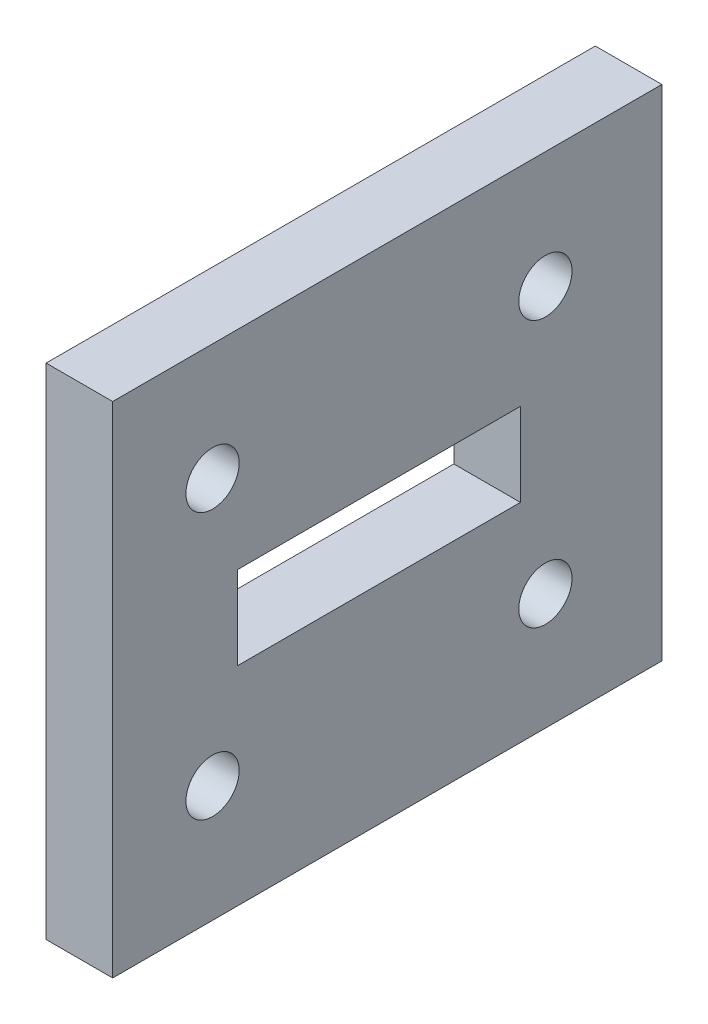
ISO-10303-21;
HEADER;
FILE_DESCRIPTION(('STEP AP214'),'2;1');
FILE_NAME('part.step','',(''),(''),'','','');
FILE_SCHEMA(('AUTOMOTIVE_DESIGN { 1 0 10303 214 1 1 1 1 }'));
ENDSEC;
DATA;
#1=APPLICATION_CONTEXT('core data for automotive mechanical design processes');
#2=APPLICATION_PROTOCOL_DEFINITION('international standard','automotive_design',2000,#1);
#3=PRODUCT_CONTEXT('',#1,'mechanical');
#4=PRODUCT('Part','Part','',(#3));
#5=PRODUCT_RELATED_PRODUCT_CATEGORY('part','',(#4));
#6=PRODUCT_DEFINITION_FORMATION('','',#4);
#7=PRODUCT_DEFINITION_CONTEXT('part definition',#1,'design');
#8=PRODUCT_DEFINITION('design','',#6,#7);
#9=PRODUCT_DEFINITION_SHAPE('','',#8);
#10=(LENGTH_UNIT() NAMED_UNIT(*) SI_UNIT(.MILLI.,.METRE.));
#11=(NAMED_UNIT(*) PLANE_ANGLE_UNIT() SI_UNIT($,.RADIAN.));
#12=(NAMED_UNIT(*) SI_UNIT($,.STERADIAN.) SOLID_ANGLE_UNIT());
#13=UNCERTAINTY_MEASURE_WITH_UNIT(LENGTH_MEASURE(1.E-05),#10,'distance_accuracy_value','');
#14=(GEOMETRIC_REPRESENTATION_CONTEXT(3) GLOBAL_UNCERTAINTY_ASSIGNED_CONTEXT((#13)) GLOBAL_UNIT_ASSIGNED_CONTEXT((#10,
#11,#12)) REPRESENTATION_CONTEXT('',''));
#15=CARTESIAN_POINT('',(0.,0.,0.));
#16=DIRECTION('',(0.,0.,1.));
#17=DIRECTION('',(1.,0.,0.));
#18=AXIS2_PLACEMENT_3D('',#15,#16,#17);
#19=CARTESIAN_POINT('',(19.4739237782046,0.,0.));
#20=DIRECTION('',(1.,0.,0.));
#21=DIRECTION('',(0.,1.,0.));
#22=AXIS2_PLACEMENT_3D('',#19,#20,#21);
#23=PLANE('',#22);
#24=DIRECTION('',(0.,0.,-1.));
#25=VECTOR('',#24,1.);
#26=CARTESIAN_POINT('',(19.4739237782046,25.9936178572667,-11.2636966730218));
#27=LINE('',#26,#25);
#28=CARTESIAN_POINT('',(19.4739237782046,25.9936178572667,5.73630332697818));
#29=VERTEX_POINT('',#28);
#30=CARTESIAN_POINT('',(19.4739237782046,25.9936178572667,-11.2636966730218));
#31=VERTEX_POINT('',#30);
#32=EDGE_CURVE('E102',#29,#31,#27,.T.);
#33=ORIENTED_EDGE('',*,*,#32,.T.);
#34=DIRECTION('',(0.,-1.,0.));
#35=VECTOR('',#34,1.);
#36=CARTESIAN_POINT('',(19.4739237782046,25.9936178572667,-11.2636966730218));
#37=LINE('',#36,#35);
#38=CARTESIAN_POINT('',(19.4739237782046,20.9936178572667,-11.2636966730218));
#39=VERTEX_POINT('',#38);
#40=EDGE_CURVE('E111',#31,#39,#37,.T.);
#41=ORIENTED_EDGE('',*,*,#40,.T.);
#42=DIRECTION('',(0.,0.,1.));
#43=VECTOR('',#42,1.);
#44=CARTESIAN_POINT('',(19.4739237782046,20.9936178572667,-11.2636966730218));
#45=LINE('',#44,#43);
#46=CARTESIAN_POINT('',(19.4739237782046,20.9936178572667,5.73630332697818));
#47=VERTEX_POINT('',#46);
#48=EDGE_CURVE('E50',#39,#47,#45,.T.);
#49=ORIENTED_EDGE('',*,*,#48,.T.);
#50=DIRECTION('',(0.,1.,0.));
#51=VECTOR('',#50,1.);
#52=CARTESIAN_POINT('',(19.4739237782046,25.9936178572667,5.73630332697818));
#53=LINE('',#52,#51);
#54=EDGE_CURVE('E108',#47,#29,#53,.T.);
#55=ORIENTED_EDGE('',*,*,#54,.T.);
#56=EDGE_LOOP('',(#33,#41,#49,#55));
#57=FACE_BOUND('',#56,.T.);
#58=CARTESIAN_POINT('',(19.4739237782046,15.4936178572667,7.23630332697818));
#59=DIRECTION('',(1.,0.,0.));
#60=DIRECTION('',(0.,0.,-1.));
#61=AXIS2_PLACEMENT_3D('',#58,#59,#60);
#62=CIRCLE('',#61,1.6);
#63=CARTESIAN_POINT('',(19.4739237782046,15.4936178572667,5.63630332697818));
#64=VERTEX_POINT('',#63);
#65=EDGE_CURVE('E142',#64,#64,#62,.T.);
#66=ORIENTED_EDGE('',*,*,#65,.F.);
#67=EDGE_LOOP('',(#66));
#68=FACE_BOUND('',#67,.T.);
#69=CARTESIAN_POINT('',(19.4739237782046,31.4936178572667,7.23630332697817));
#70=DIRECTION('',(1.,0.,0.));
#71=DIRECTION('',(0.,0.,-1.));
#72=AXIS2_PLACEMENT_3D('',#69,#70,#71);
#73=CIRCLE('',#72,1.6);
#74=CARTESIAN_POINT('',(19.4739237782046,31.4936178572667,5.63630332697818));
#75=VERTEX_POINT('',#74);
#76=EDGE_CURVE('E154',#75,#75,#73,.T.);
#77=ORIENTED_EDGE('',*,*,#76,.F.);
#78=EDGE_LOOP('',(#77));
#79=FACE_BOUND('',#78,.T.);
#80=DIRECTION('',(0.,0.,1.));
#81=VECTOR('',#80,1.);
#82=CARTESIAN_POINT('',(19.4739237782046,38.4936178572667,-19.7636966730218));
#83=LINE('',#82,#81);
#84=CARTESIAN_POINT('',(19.4739237782046,38.4936178572667,-19.7636966730218));
#85=VERTEX_POINT('',#84);
#86=CARTESIAN_POINT('',(19.4739237782046,38.4936178572667,13.2363033269782));
#87=VERTEX_POINT('',#86);
#88=EDGE_CURVE('E160',#85,#87,#83,.T.);
#89=ORIENTED_EDGE('',*,*,#88,.T.);
#90=DIRECTION('',(0.,-1.,0.));
#91=VECTOR('',#90,1.);
#92=CARTESIAN_POINT('',(19.4739237782046,38.4936178572667,13.2363033269782));
#93=LINE('',#92,#91);
#94=CARTESIAN_POINT('',(19.4739237782046,8.49361785726671,13.2363033269782));
#95=VERTEX_POINT('',#94);
#96=EDGE_CURVE('E163',#87,#95,#93,.T.);
#97=ORIENTED_EDGE('',*,*,#96,.T.);
#98=DIRECTION('',(0.,0.,-1.));
#99=VECTOR('',#98,1.);
#100=CARTESIAN_POINT('',(19.4739237782046,8.49361785726671,13.2363033269782));
#101=LINE('',#100,#99);
#102=CARTESIAN_POINT('',(19.4739237782046,8.49361785726672,-19.7636966730218));
#103=VERTEX_POINT('',#102);
#104=EDGE_CURVE('E166',#95,#103,#101,.T.);
#105=ORIENTED_EDGE('',*,*,#104,.T.);
#106=DIRECTION('',(0.,1.,0.));
#107=VECTOR('',#106,1.);
#108=CARTESIAN_POINT('',(19.4739237782046,8.49361785726672,-19.7636966730218));
#109=LINE('',#108,#107);
#110=EDGE_CURVE('E168',#103,#85,#109,.T.);
#111=ORIENTED_EDGE('',*,*,#110,.T.);
#112=EDGE_LOOP('',(#89,#97,#105,#111));
#113=FACE_BOUND('',#112,.T.);
#114=CARTESIAN_POINT('',(19.4739237782046,31.4936178572667,-12.7636966730218));
#115=DIRECTION('',(1.,0.,0.));
#116=DIRECTION('',(0.,0.,-1.));
#117=AXIS2_PLACEMENT_3D('',#114,#115,#116);
#118=CIRCLE('',#117,1.6);
#119=CARTESIAN_POINT('',(19.4739237782046,31.4936178572667,-14.3636966730218));
#120=VERTEX_POINT('',#119);
#121=EDGE_CURVE('E148',#120,#120,#118,.T.);
#122=ORIENTED_EDGE('',*,*,#121,.F.);
#123=EDGE_LOOP('',(#122));
#124=FACE_BOUND('',#123,.T.);
#125=CARTESIAN_POINT('',(19.4739237782046,15.4936178572667,-12.7636966730218));
#126=DIRECTION('',(1.,0.,0.));
#127=DIRECTION('',(0.,0.,-1.));
#128=AXIS2_PLACEMENT_3D('',#125,#126,#127);
#129=CIRCLE('',#128,1.6);
#130=CARTESIAN_POINT('',(19.4739237782046,15.4936178572667,-14.3636966730218));
#131=VERTEX_POINT('',#130);
#132=EDGE_CURVE('E136',#131,#131,#129,.T.);
#133=ORIENTED_EDGE('',*,*,#132,.F.);
#134=EDGE_LOOP('',(#133));
#135=FACE_BOUND('',#134,.T.);
#136=ADVANCED_FACE('F35',(#57,#68,#79,#113,#124,#135),#23,.T.);
#137=CARTESIAN_POINT('',(15.4739237782046,0.,0.));
#138=DIRECTION('',(1.,0.,0.));
#139=DIRECTION('',(0.,1.,0.));
#140=AXIS2_PLACEMENT_3D('',#137,#138,#139);
#141=PLANE('',#140);
#142=DIRECTION('',(0.,-1.,0.));
#143=VECTOR('',#142,1.);
#144=CARTESIAN_POINT('',(15.4739237782046,25.9936178572667,-11.2636966730218));
#145=LINE('',#144,#143);
#146=CARTESIAN_POINT('',(15.4739237782046,25.9936178572667,-11.2636966730218));
#147=VERTEX_POINT('',#146);
#148=CARTESIAN_POINT('',(15.4739237782046,20.9936178572667,-11.2636966730218));
#149=VERTEX_POINT('',#148);
#150=EDGE_CURVE('E126',#147,#149,#145,.T.);
#151=ORIENTED_EDGE('',*,*,#150,.F.);
#152=DIRECTION('',(0.,0.,-1.));
#153=VECTOR('',#152,1.);
#154=CARTESIAN_POINT('',(15.4739237782046,25.9936178572667,-11.2636966730218));
#155=LINE('',#154,#153);
#156=CARTESIAN_POINT('',(15.4739237782046,25.9936178572667,5.73630332697818));
#157=VERTEX_POINT('',#156);
#158=EDGE_CURVE('E58',#157,#147,#155,.T.);
#159=ORIENTED_EDGE('',*,*,#158,.F.);
#160=DIRECTION('',(0.,1.,0.));
#161=VECTOR('',#160,1.);
#162=CARTESIAN_POINT('',(15.4739237782046,25.9936178572667,5.73630332697818));
#163=LINE('',#162,#161);
#164=CARTESIAN_POINT('',(15.4739237782046,20.9936178572667,5.73630332697818));
#165=VERTEX_POINT('',#164);
#166=EDGE_CURVE('E117',#165,#157,#163,.T.);
#167=ORIENTED_EDGE('',*,*,#166,.F.);
#168=DIRECTION('',(0.,0.,1.));
#169=VECTOR('',#168,1.);
#170=CARTESIAN_POINT('',(15.4739237782046,20.9936178572667,-11.2636966730218));
#171=LINE('',#170,#169);
#172=EDGE_CURVE('E120',#149,#165,#171,.T.);
#173=ORIENTED_EDGE('',*,*,#172,.F.);
#174=EDGE_LOOP('',(#151,#159,#167,#173));
#175=FACE_BOUND('',#174,.T.);
#176=DIRECTION('',(0.,0.,1.));
#177=VECTOR('',#176,1.);
#178=CARTESIAN_POINT('',(15.4739237782046,38.4936178572667,-19.7636966730218));
#179=LINE('',#178,#177);
#180=CARTESIAN_POINT('',(15.4739237782046,38.4936178572667,-19.7636966730218));
#181=VERTEX_POINT('',#180);
#182=CARTESIAN_POINT('',(15.4739237782046,38.4936178572667,13.2363033269782));
#183=VERTEX_POINT('',#182);
#184=EDGE_CURVE('E157',#181,#183,#179,.T.);
#185=ORIENTED_EDGE('',*,*,#184,.F.);
#186=DIRECTION('',(0.,1.,0.));
#187=VECTOR('',#186,1.);
#188=CARTESIAN_POINT('',(15.4739237782046,8.49361785726672,-19.7636966730218));
#189=LINE('',#188,#187);
#190=CARTESIAN_POINT('',(15.4739237782046,8.49361785726672,-19.7636966730218));
#191=VERTEX_POINT('',#190);
#192=EDGE_CURVE('E164',#191,#181,#189,.T.);
#193=ORIENTED_EDGE('',*,*,#192,.F.);
#194=DIRECTION('',(0.,0.,-1.));
#195=VECTOR('',#194,1.);
#196=CARTESIAN_POINT('',(15.4739237782046,8.49361785726671,13.2363033269782));
#197=LINE('',#196,#195);
#198=CARTESIAN_POINT('',(15.4739237782046,8.49361785726671,13.2363033269782));
#199=VERTEX_POINT('',#198);
#200=EDGE_CURVE('E175',#199,#191,#197,.T.);
#201=ORIENTED_EDGE('',*,*,#200,.F.);
#202=DIRECTION('',(0.,-1.,0.));
#203=VECTOR('',#202,1.);
#204=CARTESIAN_POINT('',(15.4739237782046,38.4936178572667,13.2363033269782));
#205=LINE('',#204,#203);
#206=EDGE_CURVE('E173',#183,#199,#205,.T.);
#207=ORIENTED_EDGE('',*,*,#206,.F.);
#208=EDGE_LOOP('',(#185,#193,#201,#207));
#209=FACE_BOUND('',#208,.T.);
#210=CARTESIAN_POINT('',(15.4739237782046,31.4936178572667,7.23630332697817));
#211=DIRECTION('',(1.,0.,0.));
#212=DIRECTION('',(0.,0.,-1.));
#213=AXIS2_PLACEMENT_3D('',#210,#211,#212);
#214=CIRCLE('',#213,1.6);
#215=CARTESIAN_POINT('',(15.4739237782046,31.4936178572667,5.63630332697818));
#216=VERTEX_POINT('',#215);
#217=EDGE_CURVE('E151',#216,#216,#214,.T.);
#218=ORIENTED_EDGE('',*,*,#217,.T.);
#219=EDGE_LOOP('',(#218));
#220=FACE_BOUND('',#219,.T.);
#221=CARTESIAN_POINT('',(15.4739237782046,31.4936178572667,-12.7636966730218));
#222=DIRECTION('',(1.,0.,0.));
#223=DIRECTION('',(0.,0.,-1.));
#224=AXIS2_PLACEMENT_3D('',#221,#222,#223);
#225=CIRCLE('',#224,1.6);
#226=CARTESIAN_POINT('',(15.4739237782046,31.4936178572667,-14.3636966730218));
#227=VERTEX_POINT('',#226);
#228=EDGE_CURVE('E145',#227,#227,#225,.T.);
#229=ORIENTED_EDGE('',*,*,#228,.T.);
#230=EDGE_LOOP('',(#229));
#231=FACE_BOUND('',#230,.T.);
#232=CARTESIAN_POINT('',(15.4739237782046,15.4936178572667,7.23630332697818));
#233=DIRECTION('',(1.,0.,0.));
#234=DIRECTION('',(0.,0.,-1.));
#235=AXIS2_PLACEMENT_3D('',#232,#233,#234);
#236=CIRCLE('',#235,1.6);
#237=CARTESIAN_POINT('',(15.4739237782046,15.4936178572667,5.63630332697818));
#238=VERTEX_POINT('',#237);
#239=EDGE_CURVE('E139',#238,#238,#236,.T.);
#240=ORIENTED_EDGE('',*,*,#239,.T.);
#241=EDGE_LOOP('',(#240));
#242=FACE_BOUND('',#241,.T.);
#243=CARTESIAN_POINT('',(15.4739237782046,15.4936178572667,-12.7636966730218));
#244=DIRECTION('',(1.,0.,0.));
#245=DIRECTION('',(0.,0.,-1.));
#246=AXIS2_PLACEMENT_3D('',#243,#244,#245);
#247=CIRCLE('',#246,1.6);
#248=CARTESIAN_POINT('',(15.4739237782046,15.4936178572667,-14.3636966730218));
#249=VERTEX_POINT('',#248);
#250=EDGE_CURVE('E132',#249,#249,#247,.T.);
#251=ORIENTED_EDGE('',*,*,#250,.T.);
#252=EDGE_LOOP('',(#251));
#253=FACE_BOUND('',#252,.T.);
#254=ADVANCED_FACE('F193',(#175,#209,#220,#231,#242,#253),#141,.F.);
#255=CARTESIAN_POINT('',(19.4739237782046,38.4936178572667,-19.7636966730218));
#256=DIRECTION('',(0.,-1.,0.));
#257=DIRECTION('',(1.,0.,0.));
#258=AXIS2_PLACEMENT_3D('',#255,#256,#257);
#259=PLANE('',#258);
#260=ORIENTED_EDGE('',*,*,#184,.T.);
#261=DIRECTION('',(-1.,0.,0.));
#262=VECTOR('',#261,1.);
#263=CARTESIAN_POINT('',(19.4739237782046,38.4936178572667,13.2363033269782));
#264=LINE('',#263,#262);
#265=EDGE_CURVE('E11',#87,#183,#264,.T.);
#266=ORIENTED_EDGE('',*,*,#265,.F.);
#267=ORIENTED_EDGE('',*,*,#88,.F.);
#268=DIRECTION('',(-1.,0.,0.));
#269=VECTOR('',#268,1.);
#270=CARTESIAN_POINT('',(19.4739237782046,38.4936178572667,-19.7636966730218));
#271=LINE('',#270,#269);
#272=EDGE_CURVE('E170',#85,#181,#271,.T.);
#273=ORIENTED_EDGE('',*,*,#272,.T.);
#274=EDGE_LOOP('',(#260,#266,#267,#273));
#275=FACE_BOUND('',#274,.T.);
#276=ADVANCED_FACE('F37',(#275),#259,.F.);
#277=CARTESIAN_POINT('',(19.4739237782046,38.4936178572667,13.2363033269782));
#278=DIRECTION('',(0.,0.,-1.));
#279=DIRECTION('',(-1.,0.,0.));
#280=AXIS2_PLACEMENT_3D('',#277,#278,#279);
#281=PLANE('',#280);
#282=ORIENTED_EDGE('',*,*,#206,.T.);
#283=DIRECTION('',(-1.,0.,0.));
#284=VECTOR('',#283,1.);
#285=CARTESIAN_POINT('',(19.4739237782046,8.49361785726671,13.2363033269782));
#286=LINE('',#285,#284);
#287=EDGE_CURVE('E43',#95,#199,#286,.T.);
#288=ORIENTED_EDGE('',*,*,#287,.F.);
#289=ORIENTED_EDGE('',*,*,#96,.F.);
#290=ORIENTED_EDGE('',*,*,#265,.T.);
#291=EDGE_LOOP('',(#282,#288,#289,#290));
#292=FACE_BOUND('',#291,.T.);
#293=ADVANCED_FACE('F204',(#292),#281,.F.);
#294=CARTESIAN_POINT('',(19.4739237782046,8.49361785726671,13.2363033269782));
#295=DIRECTION('',(0.,1.,0.));
#296=DIRECTION('',(-1.,0.,0.));
#297=AXIS2_PLACEMENT_3D('',#294,#295,#296);
#298=PLANE('',#297);
#299=ORIENTED_EDGE('',*,*,#200,.T.);
#300=DIRECTION('',(-1.,0.,0.));
#301=VECTOR('',#300,1.);
#302=CARTESIAN_POINT('',(19.4739237782046,8.49361785726672,-19.7636966730218));
#303=LINE('',#302,#301);
#304=EDGE_CURVE('E180',#103,#191,#303,.T.);
#305=ORIENTED_EDGE('',*,*,#304,.F.);
#306=ORIENTED_EDGE('',*,*,#104,.F.);
#307=ORIENTED_EDGE('',*,*,#287,.T.);
#308=EDGE_LOOP('',(#299,#305,#306,#307));
#309=FACE_BOUND('',#308,.T.);
#310=ADVANCED_FACE('F187',(#309),#298,.F.);
#311=CARTESIAN_POINT('',(19.4739237782046,8.49361785726672,-19.7636966730218));
#312=DIRECTION('',(0.,0.,1.));
#313=DIRECTION('',(1.,0.,0.));
#314=AXIS2_PLACEMENT_3D('',#311,#312,#313);
#315=PLANE('',#314);
#316=ORIENTED_EDGE('',*,*,#192,.T.);
#317=ORIENTED_EDGE('',*,*,#272,.F.);
#318=ORIENTED_EDGE('',*,*,#110,.F.);
#319=ORIENTED_EDGE('',*,*,#304,.T.);
#320=EDGE_LOOP('',(#316,#317,#318,#319));
#321=FACE_BOUND('',#320,.T.);
#322=ADVANCED_FACE('F197',(#321),#315,.F.);
#323=CARTESIAN_POINT('',(19.4739237782046,31.4936178572667,7.23630332697817));
#324=DIRECTION('',(-1.,0.,0.));
#325=DIRECTION('',(0.,0.,1.));
#326=AXIS2_PLACEMENT_3D('',#323,#324,#325);
#327=CYLINDRICAL_SURFACE('',#326,1.6);
#328=ORIENTED_EDGE('',*,*,#76,.T.);
#329=EDGE_LOOP('',(#328));
#330=FACE_BOUND('',#329,.T.);
#331=ORIENTED_EDGE('',*,*,#217,.F.);
#332=EDGE_LOOP('',(#331));
#333=FACE_BOUND('',#332,.T.);
#334=ADVANCED_FACE('F219',(#330,#333),#327,.F.);
#335=CARTESIAN_POINT('',(19.4739237782046,31.4936178572667,-12.7636966730218));
#336=DIRECTION('',(-1.,0.,0.));
#337=DIRECTION('',(0.,0.,1.));
#338=AXIS2_PLACEMENT_3D('',#335,#336,#337);
#339=CYLINDRICAL_SURFACE('',#338,1.6);
#340=ORIENTED_EDGE('',*,*,#121,.T.);
#341=EDGE_LOOP('',(#340));
#342=FACE_BOUND('',#341,.T.);
#343=ORIENTED_EDGE('',*,*,#228,.F.);
#344=EDGE_LOOP('',(#343));
#345=FACE_BOUND('',#344,.T.);
#346=ADVANCED_FACE('F226',(#342,#345),#339,.F.);
#347=CARTESIAN_POINT('',(19.4739237782046,15.4936178572667,7.23630332697818));
#348=DIRECTION('',(-1.,0.,0.));
#349=DIRECTION('',(0.,0.,1.));
#350=AXIS2_PLACEMENT_3D('',#347,#348,#349);
#351=CYLINDRICAL_SURFACE('',#350,1.6);
#352=ORIENTED_EDGE('',*,*,#65,.T.);
#353=EDGE_LOOP('',(#352));
#354=FACE_BOUND('',#353,.T.);
#355=ORIENTED_EDGE('',*,*,#239,.F.);
#356=EDGE_LOOP('',(#355));
#357=FACE_BOUND('',#356,.T.);
#358=ADVANCED_FACE('F231',(#354,#357),#351,.F.);
#359=CARTESIAN_POINT('',(19.4739237782046,15.4936178572667,-12.7636966730218));
#360=DIRECTION('',(-1.,0.,0.));
#361=DIRECTION('',(0.,0.,1.));
#362=AXIS2_PLACEMENT_3D('',#359,#360,#361);
#363=CYLINDRICAL_SURFACE('',#362,1.6);
#364=ORIENTED_EDGE('',*,*,#132,.T.);
#365=EDGE_LOOP('',(#364));
#366=FACE_BOUND('',#365,.T.);
#367=ORIENTED_EDGE('',*,*,#250,.F.);
#368=EDGE_LOOP('',(#367));
#369=FACE_BOUND('',#368,.T.);
#370=ADVANCED_FACE('F243',(#366,#369),#363,.F.);
#371=CARTESIAN_POINT('',(19.4739237782046,25.9936178572667,-11.2636966730218));
#372=DIRECTION('',(0.,1.,0.));
#373=DIRECTION('',(0.,0.,1.));
#374=AXIS2_PLACEMENT_3D('',#371,#372,#373);
#375=PLANE('',#374);
#376=ORIENTED_EDGE('',*,*,#158,.T.);
#377=DIRECTION('',(-1.,0.,0.));
#378=VECTOR('',#377,1.);
#379=CARTESIAN_POINT('',(19.4739237782046,25.9936178572667,-11.2636966730218));
#380=LINE('',#379,#378);
#381=EDGE_CURVE('E98',#31,#147,#380,.T.);
#382=ORIENTED_EDGE('',*,*,#381,.F.);
#383=ORIENTED_EDGE('',*,*,#32,.F.);
#384=DIRECTION('',(-1.,0.,0.));
#385=VECTOR('',#384,1.);
#386=CARTESIAN_POINT('',(19.4739237782046,25.9936178572667,5.73630332697818));
#387=LINE('',#386,#385);
#388=EDGE_CURVE('E130',#29,#157,#387,.T.);
#389=ORIENTED_EDGE('',*,*,#388,.T.);
#390=EDGE_LOOP('',(#376,#382,#383,#389));
#391=FACE_BOUND('',#390,.T.);
#392=ADVANCED_FACE('F100',(#391),#375,.F.);
#393=CARTESIAN_POINT('',(19.4739237782046,25.9936178572667,5.73630332697818));
#394=DIRECTION('',(0.,0.,1.));
#395=DIRECTION('',(0.,-1.,0.));
#396=AXIS2_PLACEMENT_3D('',#393,#394,#395);
#397=PLANE('',#396);
#398=ORIENTED_EDGE('',*,*,#166,.T.);
#399=ORIENTED_EDGE('',*,*,#388,.F.);
#400=ORIENTED_EDGE('',*,*,#54,.F.);
#401=DIRECTION('',(-1.,0.,0.));
#402=VECTOR('',#401,1.);
#403=CARTESIAN_POINT('',(19.4739237782046,20.9936178572667,5.73630332697818));
#404=LINE('',#403,#402);
#405=EDGE_CURVE('E133',#47,#165,#404,.T.);
#406=ORIENTED_EDGE('',*,*,#405,.T.);
#407=EDGE_LOOP('',(#398,#399,#400,#406));
#408=FACE_BOUND('',#407,.T.);
#409=ADVANCED_FACE('F251',(#408),#397,.F.);
#410=CARTESIAN_POINT('',(19.4739237782046,20.9936178572667,-11.2636966730218));
#411=DIRECTION('',(0.,-1.,0.));
#412=DIRECTION('',(1.,0.,0.));
#413=AXIS2_PLACEMENT_3D('',#410,#411,#412);
#414=PLANE('',#413);
#415=ORIENTED_EDGE('',*,*,#172,.T.);
#416=ORIENTED_EDGE('',*,*,#405,.F.);
#417=ORIENTED_EDGE('',*,*,#48,.F.);
#418=DIRECTION('',(-1.,0.,0.));
#419=VECTOR('',#418,1.);
#420=CARTESIAN_POINT('',(19.4739237782046,20.9936178572667,-11.2636966730218));
#421=LINE('',#420,#419);
#422=EDGE_CURVE('E107',#39,#149,#421,.T.);
#423=ORIENTED_EDGE('',*,*,#422,.T.);
#424=EDGE_LOOP('',(#415,#416,#417,#423));
#425=FACE_BOUND('',#424,.T.);
#426=ADVANCED_FACE('F258',(#425),#414,.F.);
#427=CARTESIAN_POINT('',(19.4739237782046,25.9936178572667,-11.2636966730218));
#428=DIRECTION('',(0.,0.,-1.));
#429=DIRECTION('',(-1.,0.,0.));
#430=AXIS2_PLACEMENT_3D('',#427,#428,#429);
#431=PLANE('',#430);
#432=ORIENTED_EDGE('',*,*,#150,.T.);
#433=ORIENTED_EDGE('',*,*,#422,.F.);
#434=ORIENTED_EDGE('',*,*,#40,.F.);
#435=ORIENTED_EDGE('',*,*,#381,.T.);
#436=EDGE_LOOP('',(#432,#433,#434,#435));
#437=FACE_BOUND('',#436,.T.);
#438=ADVANCED_FACE('F112',(#437),#431,.F.);
#439=CLOSED_SHELL('',(#136,#254,#276,#293,#310,#322,#334,#346,#358,#370,#392,#409,#426,#438));
#440=MANIFOLD_SOLID_BREP('B2',#439);
#441=ADVANCED_BREP_SHAPE_REPRESENTATION('',(#18,#440),#14);
#442=SHAPE_DEFINITION_REPRESENTATION(#9,#441);
ENDSEC;
END-ISO-10303-21;
